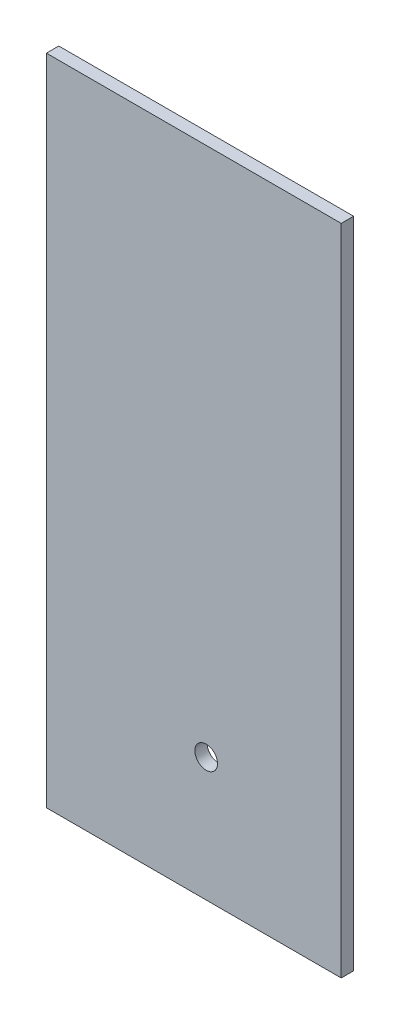
ISO-10303-21;
HEADER;
FILE_DESCRIPTION(('STEP AP214'),'2;1');
FILE_NAME('part.step','',(''),(''),'','','');
FILE_SCHEMA(('AUTOMOTIVE_DESIGN { 1 0 10303 214 1 1 1 1 }'));
ENDSEC;
DATA;
#1=APPLICATION_CONTEXT('core data for automotive mechanical design processes');
#2=APPLICATION_PROTOCOL_DEFINITION('international standard','automotive_design',2000,#1);
#3=PRODUCT_CONTEXT('',#1,'mechanical');
#4=PRODUCT('Part','Part','',(#3));
#5=PRODUCT_RELATED_PRODUCT_CATEGORY('part','',(#4));
#6=PRODUCT_DEFINITION_FORMATION('','',#4);
#7=PRODUCT_DEFINITION_CONTEXT('part definition',#1,'design');
#8=PRODUCT_DEFINITION('design','',#6,#7);
#9=PRODUCT_DEFINITION_SHAPE('','',#8);
#10=(LENGTH_UNIT() NAMED_UNIT(*) SI_UNIT(.MILLI.,.METRE.));
#11=(NAMED_UNIT(*) PLANE_ANGLE_UNIT() SI_UNIT($,.RADIAN.));
#12=(NAMED_UNIT(*) SI_UNIT($,.STERADIAN.) SOLID_ANGLE_UNIT());
#13=UNCERTAINTY_MEASURE_WITH_UNIT(LENGTH_MEASURE(1.E-05),#10,'distance_accuracy_value','');
#14=(GEOMETRIC_REPRESENTATION_CONTEXT(3) GLOBAL_UNCERTAINTY_ASSIGNED_CONTEXT((#13)) GLOBAL_UNIT_ASSIGNED_CONTEXT((#10,
#11,#12)) REPRESENTATION_CONTEXT('',''));
#15=CARTESIAN_POINT('',(0.,0.,0.));
#16=DIRECTION('',(0.,0.,1.));
#17=DIRECTION('',(1.,0.,0.));
#18=AXIS2_PLACEMENT_3D('',#15,#16,#17);
#19=CARTESIAN_POINT('',(71.5,-158.5,6.));
#20=DIRECTION('',(-1.,0.,0.));
#21=DIRECTION('',(0.,0.,1.));
#22=AXIS2_PLACEMENT_3D('',#19,#20,#21);
#23=PLANE('',#22);
#24=DIRECTION('',(0.,1.,0.));
#25=VECTOR('',#24,1.);
#26=CARTESIAN_POINT('',(71.5,-158.5,0.));
#27=LINE('',#26,#25);
#28=CARTESIAN_POINT('',(71.5,-158.5,0.));
#29=VERTEX_POINT('',#28);
#30=CARTESIAN_POINT('',(71.5,158.5,0.));
#31=VERTEX_POINT('',#30);
#32=EDGE_CURVE('E100',#29,#31,#27,.T.);
#33=ORIENTED_EDGE('',*,*,#32,.T.);
#34=DIRECTION('',(0.,0.,-1.));
#35=VECTOR('',#34,1.);
#36=CARTESIAN_POINT('',(71.5,158.5,6.));
#37=LINE('',#36,#35);
#38=CARTESIAN_POINT('',(71.5,158.5,6.));
#39=VERTEX_POINT('',#38);
#40=EDGE_CURVE('E11',#39,#31,#37,.T.);
#41=ORIENTED_EDGE('',*,*,#40,.F.);
#42=DIRECTION('',(0.,1.,0.));
#43=VECTOR('',#42,1.);
#44=CARTESIAN_POINT('',(71.5,-158.5,6.));
#45=LINE('',#44,#43);
#46=CARTESIAN_POINT('',(71.5,-158.5,6.));
#47=VERTEX_POINT('',#46);
#48=EDGE_CURVE('E88',#47,#39,#45,.T.);
#49=ORIENTED_EDGE('',*,*,#48,.F.);
#50=DIRECTION('',(0.,0.,-1.));
#51=VECTOR('',#50,1.);
#52=CARTESIAN_POINT('',(71.5,-158.5,6.));
#53=LINE('',#52,#51);
#54=EDGE_CURVE('E96',#47,#29,#53,.T.);
#55=ORIENTED_EDGE('',*,*,#54,.T.);
#56=EDGE_LOOP('',(#33,#41,#49,#55));
#57=FACE_BOUND('',#56,.T.);
#58=ADVANCED_FACE('F37',(#57),#23,.F.);
#59=CARTESIAN_POINT('',(-71.5,158.5,6.));
#60=DIRECTION('',(0.,-1.,0.));
#61=DIRECTION('',(0.,0.,-1.));
#62=AXIS2_PLACEMENT_3D('',#59,#60,#61);
#63=PLANE('',#62);
#64=DIRECTION('',(-1.,0.,0.));
#65=VECTOR('',#64,1.);
#66=CARTESIAN_POINT('',(-71.5,158.5,0.));
#67=LINE('',#66,#65);
#68=CARTESIAN_POINT('',(-71.5,158.5,0.));
#69=VERTEX_POINT('',#68);
#70=EDGE_CURVE('E92',#31,#69,#67,.T.);
#71=ORIENTED_EDGE('',*,*,#70,.T.);
#72=DIRECTION('',(0.,0.,-1.));
#73=VECTOR('',#72,1.);
#74=CARTESIAN_POINT('',(-71.5,158.5,6.));
#75=LINE('',#74,#73);
#76=CARTESIAN_POINT('',(-71.5,158.5,6.));
#77=VERTEX_POINT('',#76);
#78=EDGE_CURVE('E45',#77,#69,#75,.T.);
#79=ORIENTED_EDGE('',*,*,#78,.F.);
#80=DIRECTION('',(-1.,0.,0.));
#81=VECTOR('',#80,1.);
#82=CARTESIAN_POINT('',(-71.5,158.5,6.));
#83=LINE('',#82,#81);
#84=EDGE_CURVE('E83',#39,#77,#83,.T.);
#85=ORIENTED_EDGE('',*,*,#84,.F.);
#86=ORIENTED_EDGE('',*,*,#40,.T.);
#87=EDGE_LOOP('',(#71,#79,#85,#86));
#88=FACE_BOUND('',#87,.T.);
#89=ADVANCED_FACE('F91',(#88),#63,.F.);
#90=CARTESIAN_POINT('',(-71.5,-158.5,6.));
#91=DIRECTION('',(1.,0.,0.));
#92=DIRECTION('',(0.,0.,-1.));
#93=AXIS2_PLACEMENT_3D('',#90,#91,#92);
#94=PLANE('',#93);
#95=DIRECTION('',(0.,-1.,0.));
#96=VECTOR('',#95,1.);
#97=CARTESIAN_POINT('',(-71.5,-158.5,0.));
#98=LINE('',#97,#96);
#99=CARTESIAN_POINT('',(-71.5,-158.5,0.));
#100=VERTEX_POINT('',#99);
#101=EDGE_CURVE('E70',#69,#100,#98,.T.);
#102=ORIENTED_EDGE('',*,*,#101,.T.);
#103=DIRECTION('',(0.,0.,-1.));
#104=VECTOR('',#103,1.);
#105=CARTESIAN_POINT('',(-71.5,-158.5,6.));
#106=LINE('',#105,#104);
#107=CARTESIAN_POINT('',(-71.5,-158.5,6.));
#108=VERTEX_POINT('',#107);
#109=EDGE_CURVE('E93',#108,#100,#106,.T.);
#110=ORIENTED_EDGE('',*,*,#109,.F.);
#111=DIRECTION('',(0.,-1.,0.));
#112=VECTOR('',#111,1.);
#113=CARTESIAN_POINT('',(-71.5,-158.5,6.));
#114=LINE('',#113,#112);
#115=EDGE_CURVE('E86',#77,#108,#114,.T.);
#116=ORIENTED_EDGE('',*,*,#115,.F.);
#117=ORIENTED_EDGE('',*,*,#78,.T.);
#118=EDGE_LOOP('',(#102,#110,#116,#117));
#119=FACE_BOUND('',#118,.T.);
#120=ADVANCED_FACE('F94',(#119),#94,.F.);
#121=CARTESIAN_POINT('',(-71.5,-158.5,6.));
#122=DIRECTION('',(0.,1.,0.));
#123=DIRECTION('',(0.,0.,1.));
#124=AXIS2_PLACEMENT_3D('',#121,#122,#123);
#125=PLANE('',#124);
#126=DIRECTION('',(1.,0.,0.));
#127=VECTOR('',#126,1.);
#128=CARTESIAN_POINT('',(-71.5,-158.5,0.));
#129=LINE('',#128,#127);
#130=EDGE_CURVE('E76',#100,#29,#129,.T.);
#131=ORIENTED_EDGE('',*,*,#130,.T.);
#132=ORIENTED_EDGE('',*,*,#54,.F.);
#133=DIRECTION('',(1.,0.,0.));
#134=VECTOR('',#133,1.);
#135=CARTESIAN_POINT('',(-71.5,-158.5,6.));
#136=LINE('',#135,#134);
#137=EDGE_CURVE('E53',#108,#47,#136,.T.);
#138=ORIENTED_EDGE('',*,*,#137,.F.);
#139=ORIENTED_EDGE('',*,*,#109,.T.);
#140=EDGE_LOOP('',(#131,#132,#138,#139));
#141=FACE_BOUND('',#140,.T.);
#142=ADVANCED_FACE('F108',(#141),#125,.F.);
#143=CARTESIAN_POINT('',(0.,0.,6.));
#144=DIRECTION('',(0.,0.,-1.));
#145=DIRECTION('',(-1.,0.,0.));
#146=AXIS2_PLACEMENT_3D('',#143,#144,#145);
#147=PLANE('',#146);
#148=CARTESIAN_POINT('',(6.,-98.5,6.));
#149=DIRECTION('',(0.,0.,1.));
#150=DIRECTION('',(1.,0.,0.));
#151=AXIS2_PLACEMENT_3D('',#148,#149,#150);
#152=CIRCLE('',#151,5.50000000000001);
#153=CARTESIAN_POINT('',(11.5,-98.5,6.));
#154=VERTEX_POINT('',#153);
#155=EDGE_CURVE('E114',#154,#154,#152,.T.);
#156=ORIENTED_EDGE('',*,*,#155,.F.);
#157=EDGE_LOOP('',(#156));
#158=FACE_BOUND('',#157,.T.);
#159=ORIENTED_EDGE('',*,*,#48,.T.);
#160=ORIENTED_EDGE('',*,*,#84,.T.);
#161=ORIENTED_EDGE('',*,*,#115,.T.);
#162=ORIENTED_EDGE('',*,*,#137,.T.);
#163=EDGE_LOOP('',(#159,#160,#161,#162));
#164=FACE_BOUND('',#163,.T.);
#165=ADVANCED_FACE('F84',(#158,#164),#147,.F.);
#166=CARTESIAN_POINT('',(0.,0.,0.));
#167=DIRECTION('',(0.,0.,-1.));
#168=DIRECTION('',(-1.,0.,0.));
#169=AXIS2_PLACEMENT_3D('',#166,#167,#168);
#170=PLANE('',#169);
#171=CARTESIAN_POINT('',(6.,-98.5,0.));
#172=DIRECTION('',(0.,0.,1.));
#173=DIRECTION('',(1.,0.,0.));
#174=AXIS2_PLACEMENT_3D('',#171,#172,#173);
#175=CIRCLE('',#174,5.50000000000001);
#176=CARTESIAN_POINT('',(11.5,-98.5,0.));
#177=VERTEX_POINT('',#176);
#178=EDGE_CURVE('E103',#177,#177,#175,.T.);
#179=ORIENTED_EDGE('',*,*,#178,.T.);
#180=EDGE_LOOP('',(#179));
#181=FACE_BOUND('',#180,.T.);
#182=ORIENTED_EDGE('',*,*,#32,.F.);
#183=ORIENTED_EDGE('',*,*,#130,.F.);
#184=ORIENTED_EDGE('',*,*,#101,.F.);
#185=ORIENTED_EDGE('',*,*,#70,.F.);
#186=EDGE_LOOP('',(#182,#183,#184,#185));
#187=FACE_BOUND('',#186,.T.);
#188=ADVANCED_FACE('F111',(#181,#187),#170,.T.);
#189=CARTESIAN_POINT('',(6.,-98.5,0.));
#190=DIRECTION('',(0.,0.,1.));
#191=DIRECTION('',(1.,0.,0.));
#192=AXIS2_PLACEMENT_3D('',#189,#190,#191);
#193=CYLINDRICAL_SURFACE('',#192,5.50000000000001);
#194=ORIENTED_EDGE('',*,*,#178,.F.);
#195=EDGE_LOOP('',(#194));
#196=FACE_BOUND('',#195,.T.);
#197=ORIENTED_EDGE('',*,*,#155,.T.);
#198=EDGE_LOOP('',(#197));
#199=FACE_BOUND('',#198,.T.);
#200=ADVANCED_FACE('F121',(#196,#199),#193,.F.);
#201=CLOSED_SHELL('',(#58,#89,#120,#142,#165,#188,#200));
#202=MANIFOLD_SOLID_BREP('B2',#201);
#203=ADVANCED_BREP_SHAPE_REPRESENTATION('',(#18,#202),#14);
#204=SHAPE_DEFINITION_REPRESENTATION(#9,#203);
ENDSEC;
END-ISO-10303-21;
